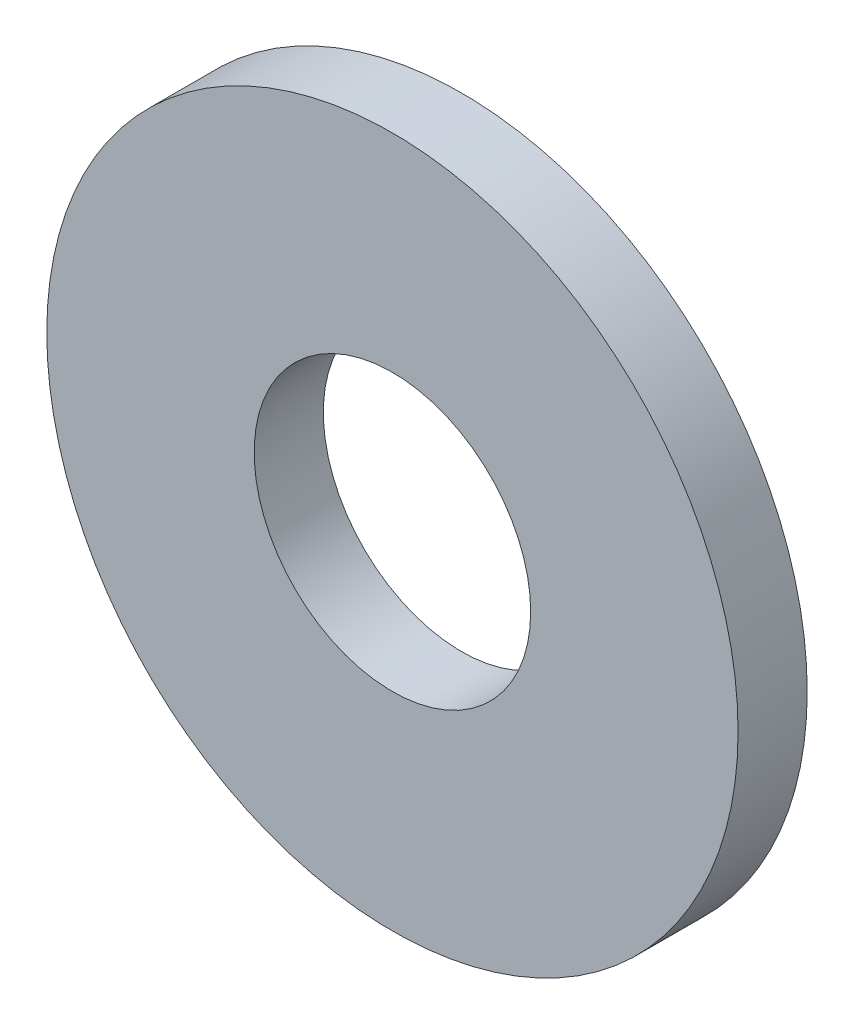
ISO-10303-21;
HEADER;
FILE_DESCRIPTION(('STEP AP214'),'2;1');
FILE_NAME('part.step','',(''),(''),'','','');
FILE_SCHEMA(('AUTOMOTIVE_DESIGN { 1 0 10303 214 1 1 1 1 }'));
ENDSEC;
DATA;
#1=APPLICATION_CONTEXT('core data for automotive mechanical design processes');
#2=APPLICATION_PROTOCOL_DEFINITION('international standard','automotive_design',2000,#1);
#3=PRODUCT_CONTEXT('',#1,'mechanical');
#4=PRODUCT('Part','Part','',(#3));
#5=PRODUCT_RELATED_PRODUCT_CATEGORY('part','',(#4));
#6=PRODUCT_DEFINITION_FORMATION('','',#4);
#7=PRODUCT_DEFINITION_CONTEXT('part definition',#1,'design');
#8=PRODUCT_DEFINITION('design','',#6,#7);
#9=PRODUCT_DEFINITION_SHAPE('','',#8);
#10=(LENGTH_UNIT() NAMED_UNIT(*) SI_UNIT(.MILLI.,.METRE.));
#11=(NAMED_UNIT(*) PLANE_ANGLE_UNIT() SI_UNIT($,.RADIAN.));
#12=(NAMED_UNIT(*) SI_UNIT($,.STERADIAN.) SOLID_ANGLE_UNIT());
#13=UNCERTAINTY_MEASURE_WITH_UNIT(LENGTH_MEASURE(1.E-05),#10,'distance_accuracy_value','');
#14=(GEOMETRIC_REPRESENTATION_CONTEXT(3) GLOBAL_UNCERTAINTY_ASSIGNED_CONTEXT((#13)) GLOBAL_UNIT_ASSIGNED_CONTEXT((#10,
#11,#12)) REPRESENTATION_CONTEXT('',''));
#15=CARTESIAN_POINT('',(0.,0.,0.));
#16=DIRECTION('',(0.,0.,1.));
#17=DIRECTION('',(1.,0.,0.));
#18=AXIS2_PLACEMENT_3D('',#15,#16,#17);
#19=CARTESIAN_POINT('',(0.,0.,1.5875));
#20=DIRECTION('',(0.,0.,1.));
#21=DIRECTION('',(1.,0.,0.));
#22=AXIS2_PLACEMENT_3D('',#19,#20,#21);
#23=PLANE('',#22);
#24=CARTESIAN_POINT('',(0.,0.,1.5875));
#25=DIRECTION('',(0.,0.,1.));
#26=DIRECTION('',(1.,0.,0.));
#27=AXIS2_PLACEMENT_3D('',#24,#25,#26);
#28=CIRCLE('',#27,7.9375);
#29=CARTESIAN_POINT('',(7.9375,0.,1.5875));
#30=VERTEX_POINT('',#29);
#31=EDGE_CURVE('E10',#30,#30,#28,.T.);
#32=ORIENTED_EDGE('',*,*,#31,.T.);
#33=EDGE_LOOP('',(#32));
#34=FACE_BOUND('',#33,.T.);
#35=CARTESIAN_POINT('',(0.,0.,1.5875));
#36=DIRECTION('',(0.,0.,1.));
#37=DIRECTION('',(1.,0.,0.));
#38=AXIS2_PLACEMENT_3D('',#35,#36,#37);
#39=CIRCLE('',#38,3.175);
#40=CARTESIAN_POINT('',(3.175,0.,1.5875));
#41=VERTEX_POINT('',#40);
#42=EDGE_CURVE('E42',#41,#41,#39,.T.);
#43=ORIENTED_EDGE('',*,*,#42,.F.);
#44=EDGE_LOOP('',(#43));
#45=FACE_BOUND('',#44,.T.);
#46=ADVANCED_FACE('F31',(#34,#45),#23,.T.);
#47=CARTESIAN_POINT('',(0.,0.,0.));
#48=DIRECTION('',(0.,0.,1.));
#49=DIRECTION('',(1.,0.,0.));
#50=AXIS2_PLACEMENT_3D('',#47,#48,#49);
#51=PLANE('',#50);
#52=CARTESIAN_POINT('',(0.,0.,0.));
#53=DIRECTION('',(0.,0.,1.));
#54=DIRECTION('',(1.,0.,0.));
#55=AXIS2_PLACEMENT_3D('',#52,#53,#54);
#56=CIRCLE('',#55,7.9375);
#57=CARTESIAN_POINT('',(7.9375,0.,0.));
#58=VERTEX_POINT('',#57);
#59=EDGE_CURVE('E35',#58,#58,#56,.T.);
#60=ORIENTED_EDGE('',*,*,#59,.F.);
#61=EDGE_LOOP('',(#60));
#62=FACE_BOUND('',#61,.T.);
#63=CARTESIAN_POINT('',(0.,0.,0.));
#64=DIRECTION('',(0.,0.,1.));
#65=DIRECTION('',(1.,0.,0.));
#66=AXIS2_PLACEMENT_3D('',#63,#64,#65);
#67=CIRCLE('',#66,3.175);
#68=CARTESIAN_POINT('',(3.175,0.,0.));
#69=VERTEX_POINT('',#68);
#70=EDGE_CURVE('E44',#69,#69,#67,.T.);
#71=ORIENTED_EDGE('',*,*,#70,.T.);
#72=EDGE_LOOP('',(#71));
#73=FACE_BOUND('',#72,.T.);
#74=ADVANCED_FACE('F54',(#62,#73),#51,.F.);
#75=CARTESIAN_POINT('',(0.,0.,1.5875));
#76=DIRECTION('',(0.,0.,-1.));
#77=DIRECTION('',(-1.,0.,0.));
#78=AXIS2_PLACEMENT_3D('',#75,#76,#77);
#79=CYLINDRICAL_SURFACE('',#78,7.9375);
#80=ORIENTED_EDGE('',*,*,#31,.F.);
#81=EDGE_LOOP('',(#80));
#82=FACE_BOUND('',#81,.T.);
#83=ORIENTED_EDGE('',*,*,#59,.T.);
#84=EDGE_LOOP('',(#83));
#85=FACE_BOUND('',#84,.T.);
#86=ADVANCED_FACE('F33',(#82,#85),#79,.T.);
#87=CARTESIAN_POINT('',(0.,0.,1.5875));
#88=DIRECTION('',(0.,0.,-1.));
#89=DIRECTION('',(-1.,0.,0.));
#90=AXIS2_PLACEMENT_3D('',#87,#88,#89);
#91=CYLINDRICAL_SURFACE('',#90,3.175);
#92=ORIENTED_EDGE('',*,*,#42,.T.);
#93=EDGE_LOOP('',(#92));
#94=FACE_BOUND('',#93,.T.);
#95=ORIENTED_EDGE('',*,*,#70,.F.);
#96=EDGE_LOOP('',(#95));
#97=FACE_BOUND('',#96,.T.);
#98=ADVANCED_FACE('F50',(#94,#97),#91,.F.);
#99=CLOSED_SHELL('',(#46,#74,#86,#98));
#100=MANIFOLD_SOLID_BREP('B2',#99);
#101=ADVANCED_BREP_SHAPE_REPRESENTATION('',(#18,#100),#14);
#102=SHAPE_DEFINITION_REPRESENTATION(#9,#101);
ENDSEC;
END-ISO-10303-21;
